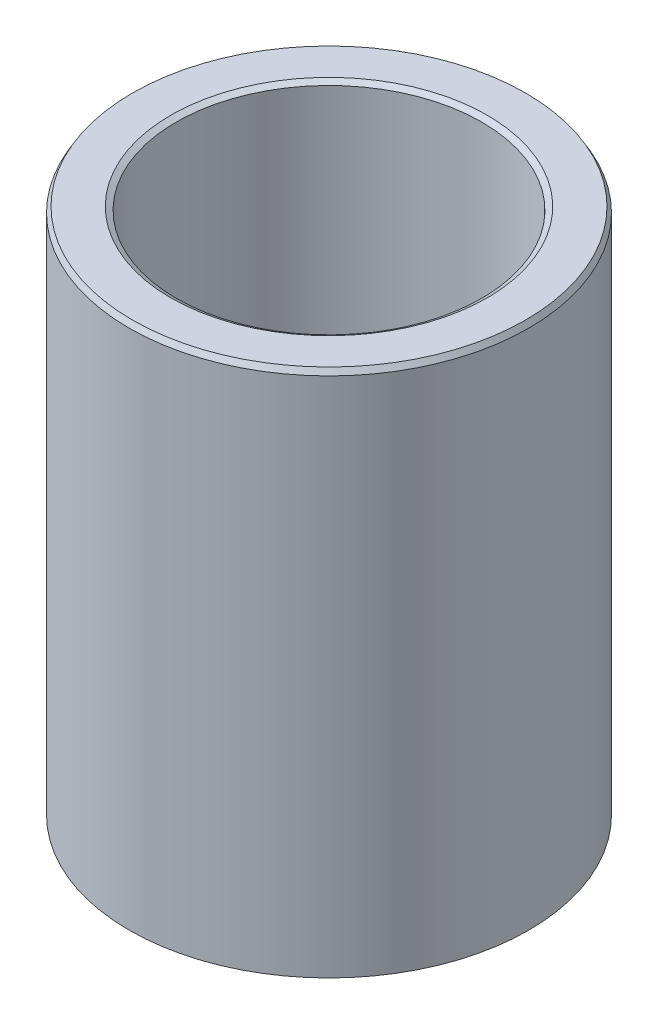
ISO-10303-21;
HEADER;
FILE_DESCRIPTION(('STEP AP214'),'2;1');
FILE_NAME('part.step','',(''),(''),'','','');
FILE_SCHEMA(('AUTOMOTIVE_DESIGN { 1 0 10303 214 1 1 1 1 }'));
ENDSEC;
DATA;
#1=APPLICATION_CONTEXT('core data for automotive mechanical design processes');
#2=APPLICATION_PROTOCOL_DEFINITION('international standard','automotive_design',2000,#1);
#3=PRODUCT_CONTEXT('',#1,'mechanical');
#4=PRODUCT('Part','Part','',(#3));
#5=PRODUCT_RELATED_PRODUCT_CATEGORY('part','',(#4));
#6=PRODUCT_DEFINITION_FORMATION('','',#4);
#7=PRODUCT_DEFINITION_CONTEXT('part definition',#1,'design');
#8=PRODUCT_DEFINITION('design','',#6,#7);
#9=PRODUCT_DEFINITION_SHAPE('','',#8);
#10=(LENGTH_UNIT() NAMED_UNIT(*) SI_UNIT(.MILLI.,.METRE.));
#11=(NAMED_UNIT(*) PLANE_ANGLE_UNIT() SI_UNIT($,.RADIAN.));
#12=(NAMED_UNIT(*) SI_UNIT($,.STERADIAN.) SOLID_ANGLE_UNIT());
#13=UNCERTAINTY_MEASURE_WITH_UNIT(LENGTH_MEASURE(1.E-05),#10,'distance_accuracy_value','');
#14=(GEOMETRIC_REPRESENTATION_CONTEXT(3) GLOBAL_UNCERTAINTY_ASSIGNED_CONTEXT((#13)) GLOBAL_UNIT_ASSIGNED_CONTEXT((#10,
#11,#12)) REPRESENTATION_CONTEXT('',''));
#15=CARTESIAN_POINT('',(0.,0.,0.));
#16=DIRECTION('',(0.,0.,1.));
#17=DIRECTION('',(1.,0.,0.));
#18=AXIS2_PLACEMENT_3D('',#15,#16,#17);
#19=CARTESIAN_POINT('',(0.,46.4336161929671,0.));
#20=DIRECTION('',(0.,-1.,0.));
#21=DIRECTION('',(0.,0.,-1.));
#22=AXIS2_PLACEMENT_3D('',#19,#20,#21);
#23=CYLINDRICAL_SURFACE('',#22,17.5);
#24=CARTESIAN_POINT('',(0.,0.277660741693039,0.));
#25=DIRECTION('',(0.,1.,0.));
#26=DIRECTION('',(0.,0.,1.));
#27=AXIS2_PLACEMENT_3D('',#24,#25,#26);
#28=CIRCLE('',#27,17.5);
#29=CARTESIAN_POINT('',(0.,0.277660741693039,17.5));
#30=VERTEX_POINT('',#29);
#31=EDGE_CURVE('E10',#30,#30,#28,.T.);
#32=ORIENTED_EDGE('',*,*,#31,.T.);
#33=EDGE_LOOP('',(#32));
#34=FACE_BOUND('',#33,.T.);
#35=CARTESIAN_POINT('',(0.,45.9526936810874,0.));
#36=DIRECTION('',(0.,1.,0.));
#37=DIRECTION('',(0.,0.,1.));
#38=AXIS2_PLACEMENT_3D('',#35,#36,#37);
#39=CIRCLE('',#38,17.5);
#40=CARTESIAN_POINT('',(0.,45.9526936810874,-17.5));
#41=VERTEX_POINT('',#40);
#42=EDGE_CURVE('E50',#41,#41,#39,.F.);
#43=ORIENTED_EDGE('',*,*,#42,.T.);
#44=EDGE_LOOP('',(#43));
#45=FACE_BOUND('',#44,.T.);
#46=ADVANCED_FACE('F39',(#34,#45),#23,.T.);
#47=CARTESIAN_POINT('',(0.,46.4336161929671,0.));
#48=DIRECTION('',(0.,1.,0.));
#49=DIRECTION('',(0.,0.,1.));
#50=AXIS2_PLACEMENT_3D('',#47,#48,#49);
#51=PLANE('',#50);
#52=CARTESIAN_POINT('',(0.,46.4336161929671,0.));
#53=DIRECTION('',(0.,1.,0.));
#54=DIRECTION('',(0.,0.,1.));
#55=AXIS2_PLACEMENT_3D('',#52,#53,#54);
#56=CIRCLE('',#55,13.8599849736246);
#57=CARTESIAN_POINT('',(0.,46.4336161929671,13.8599849736246));
#58=VERTEX_POINT('',#57);
#59=EDGE_CURVE('E58',#58,#58,#56,.F.);
#60=ORIENTED_EDGE('',*,*,#59,.T.);
#61=EDGE_LOOP('',(#60));
#62=FACE_BOUND('',#61,.T.);
#63=CARTESIAN_POINT('',(0.,46.4336161929671,0.));
#64=DIRECTION('',(0.,1.,0.));
#65=DIRECTION('',(0.,0.,1.));
#66=AXIS2_PLACEMENT_3D('',#63,#64,#65);
#67=CIRCLE('',#66,17.222339258307);
#68=CARTESIAN_POINT('',(0.,46.4336161929671,-17.222339258307));
#69=VERTEX_POINT('',#68);
#70=EDGE_CURVE('E61',#69,#69,#67,.T.);
#71=ORIENTED_EDGE('',*,*,#70,.T.);
#72=EDGE_LOOP('',(#71));
#73=FACE_BOUND('',#72,.T.);
#74=ADVANCED_FACE('F88',(#62,#73),#51,.T.);
#75=CARTESIAN_POINT('',(0.,0.,0.));
#76=DIRECTION('',(0.,1.,0.));
#77=DIRECTION('',(0.,0.,1.));
#78=AXIS2_PLACEMENT_3D('',#75,#76,#77);
#79=PLANE('',#78);
#80=CARTESIAN_POINT('',(0.,0.,0.));
#81=DIRECTION('',(0.,1.,0.));
#82=DIRECTION('',(0.,0.,1.));
#83=AXIS2_PLACEMENT_3D('',#80,#81,#82);
#84=CIRCLE('',#83,13.656723203438);
#85=CARTESIAN_POINT('',(0.,0.,13.656723203438));
#86=VERTEX_POINT('',#85);
#87=EDGE_CURVE('E51',#86,#86,#84,.T.);
#88=ORIENTED_EDGE('',*,*,#87,.T.);
#89=EDGE_LOOP('',(#88));
#90=FACE_BOUND('',#89,.T.);
#91=CARTESIAN_POINT('',(0.,0.,0.));
#92=DIRECTION('',(0.,1.,0.));
#93=DIRECTION('',(0.,0.,1.));
#94=AXIS2_PLACEMENT_3D('',#91,#92,#93);
#95=CIRCLE('',#94,17.0190774881204);
#96=CARTESIAN_POINT('',(0.,0.,17.0190774881204));
#97=VERTEX_POINT('',#96);
#98=EDGE_CURVE('E54',#97,#97,#95,.F.);
#99=ORIENTED_EDGE('',*,*,#98,.T.);
#100=EDGE_LOOP('',(#99));
#101=FACE_BOUND('',#100,.T.);
#102=ADVANCED_FACE('F83',(#90,#101),#79,.F.);
#103=CARTESIAN_POINT('',(0.,46.4336161929671,0.));
#104=DIRECTION('',(0.,-1.,0.));
#105=DIRECTION('',(0.,0.,-1.));
#106=AXIS2_PLACEMENT_3D('',#103,#104,#105);
#107=CYLINDRICAL_SURFACE('',#106,13.379062461745);
#108=CARTESIAN_POINT('',(0.,46.155955451274,0.));
#109=DIRECTION('',(0.,1.,0.));
#110=DIRECTION('',(0.,0.,1.));
#111=AXIS2_PLACEMENT_3D('',#108,#109,#110);
#112=CIRCLE('',#111,13.379062461745);
#113=CARTESIAN_POINT('',(0.,46.155955451274,13.379062461745));
#114=VERTEX_POINT('',#113);
#115=EDGE_CURVE('E67',#114,#114,#112,.T.);
#116=ORIENTED_EDGE('',*,*,#115,.T.);
#117=EDGE_LOOP('',(#116));
#118=FACE_BOUND('',#117,.T.);
#119=CARTESIAN_POINT('',(0.,0.480922511879589,0.));
#120=DIRECTION('',(0.,1.,0.));
#121=DIRECTION('',(0.,0.,1.));
#122=AXIS2_PLACEMENT_3D('',#119,#120,#121);
#123=CIRCLE('',#122,13.379062461745);
#124=CARTESIAN_POINT('',(0.,0.480922511879589,13.379062461745));
#125=VERTEX_POINT('',#124);
#126=EDGE_CURVE('E69',#125,#125,#123,.F.);
#127=ORIENTED_EDGE('',*,*,#126,.T.);
#128=EDGE_LOOP('',(#127));
#129=FACE_BOUND('',#128,.T.);
#130=ADVANCED_FACE('F71',(#118,#129),#107,.F.);
#131=CARTESIAN_POINT('',(0.,46.155955451274,0.));
#132=DIRECTION('',(0.,1.,0.));
#133=DIRECTION('',(0.,0.,1.));
#134=AXIS2_PLACEMENT_3D('',#131,#132,#133);
#135=CONICAL_SURFACE('',#134,13.379062461745,1.04719755119659);
#136=ORIENTED_EDGE('',*,*,#59,.F.);
#137=EDGE_LOOP('',(#136));
#138=FACE_BOUND('',#137,.T.);
#139=ORIENTED_EDGE('',*,*,#115,.F.);
#140=EDGE_LOOP('',(#139));
#141=FACE_BOUND('',#140,.T.);
#142=ADVANCED_FACE('F77',(#138,#141),#135,.F.);
#143=CARTESIAN_POINT('',(0.,0.,0.));
#144=DIRECTION('',(0.,-1.,0.));
#145=DIRECTION('',(0.,0.,-1.));
#146=AXIS2_PLACEMENT_3D('',#143,#144,#145);
#147=CONICAL_SURFACE('',#146,13.656723203438,0.523598775598294);
#148=ORIENTED_EDGE('',*,*,#126,.F.);
#149=EDGE_LOOP('',(#148));
#150=FACE_BOUND('',#149,.T.);
#151=ORIENTED_EDGE('',*,*,#87,.F.);
#152=EDGE_LOOP('',(#151));
#153=FACE_BOUND('',#152,.T.);
#154=ADVANCED_FACE('F73',(#150,#153),#147,.F.);
#155=CARTESIAN_POINT('',(0.,0.277660741693039,0.));
#156=DIRECTION('',(0.,1.,0.));
#157=DIRECTION('',(0.,0.,1.));
#158=AXIS2_PLACEMENT_3D('',#155,#156,#157);
#159=CONICAL_SURFACE('',#158,17.5,1.0471975511966);
#160=ORIENTED_EDGE('',*,*,#98,.F.);
#161=EDGE_LOOP('',(#160));
#162=FACE_BOUND('',#161,.T.);
#163=ORIENTED_EDGE('',*,*,#31,.F.);
#164=EDGE_LOOP('',(#163));
#165=FACE_BOUND('',#164,.T.);
#166=ADVANCED_FACE('F76',(#162,#165),#159,.T.);
#167=CARTESIAN_POINT('',(0.,46.4336161929671,0.));
#168=DIRECTION('',(0.,-1.,0.));
#169=DIRECTION('',(0.,0.,-1.));
#170=AXIS2_PLACEMENT_3D('',#167,#168,#169);
#171=CONICAL_SURFACE('',#170,17.222339258307,0.523598775598285);
#172=CARTESIAN_POINT('',(0.,45.9526936810874,-17.5));
#173=CARTESIAN_POINT('',(0.,45.9577032905862,-17.4971077006074));
#174=CARTESIAN_POINT('',(0.,45.9627129000849,-17.4942154012147));
#175=CARTESIAN_POINT('',(0.,45.9727321190824,-17.4884308024295));
#176=CARTESIAN_POINT('',(0.,45.9777417285812,-17.4855385030368));
#177=CARTESIAN_POINT('',(0.,45.9877609475787,-17.4797539042516));
#178=CARTESIAN_POINT('',(0.,45.9927705570774,-17.4768616048589));
#179=CARTESIAN_POINT('',(0.,46.0027897760749,-17.4710770060736));
#180=CARTESIAN_POINT('',(0.,46.0077993855736,-17.468184706681));
#181=CARTESIAN_POINT('',(0.,46.0178186045711,-17.4624001078957));
#182=CARTESIAN_POINT('',(0.,46.0228282140699,-17.4595078085031));
#183=CARTESIAN_POINT('',(0.,46.0328474330674,-17.4537232097178));
#184=CARTESIAN_POINT('',(0.,46.0378570425661,-17.4508309103252));
#185=CARTESIAN_POINT('',(0.,46.0478762615636,-17.4450463115399));
#186=CARTESIAN_POINT('',(0.,46.0528858710624,-17.4421540121473));
#187=CARTESIAN_POINT('',(0.,46.0629050900599,-17.436369413362));
#188=CARTESIAN_POINT('',(0.,46.0679146995586,-17.4334771139694));
#189=CARTESIAN_POINT('',(0.,46.0779339185561,-17.4276925151841));
#190=CARTESIAN_POINT('',(0.,46.0829435280548,-17.4248002157915));
#191=CARTESIAN_POINT('',(0.,46.0929627470523,-17.4190156170062));
#192=CARTESIAN_POINT('',(0.,46.0979723565511,-17.4161233176136));
#193=CARTESIAN_POINT('',(0.,46.1079915755486,-17.4103387188283));
#194=CARTESIAN_POINT('',(0.,46.1130011850473,-17.4074464194357));
#195=CARTESIAN_POINT('',(0.,46.1230204040448,-17.4016618206504));
#196=CARTESIAN_POINT('',(0.,46.1280300135436,-17.3987695212578));
#197=CARTESIAN_POINT('',(0.,46.138049232541,-17.3929849224725));
#198=CARTESIAN_POINT('',(0.,46.1430588420398,-17.3900926230798));
#199=CARTESIAN_POINT('',(0.,46.1530780610373,-17.3843080242946));
#200=CARTESIAN_POINT('',(0.,46.158087670536,-17.3814157249019));
#201=CARTESIAN_POINT('',(0.,46.1681068895335,-17.3756311261167));
#202=CARTESIAN_POINT('',(0.,46.1731164990323,-17.372738826724));
#203=CARTESIAN_POINT('',(0.,46.1831357180298,-17.3669542279388));
#204=CARTESIAN_POINT('',(0.,46.1881453275285,-17.3640619285461));
#205=CARTESIAN_POINT('',(0.,46.198164546526,-17.3582773297608));
#206=CARTESIAN_POINT('',(0.,46.2031741560247,-17.3553850303682));
#207=CARTESIAN_POINT('',(0.,46.2131933750222,-17.3496004315829));
#208=CARTESIAN_POINT('',(0.,46.218202984521,-17.3467081321903));
#209=CARTESIAN_POINT('',(0.,46.2282222035185,-17.340923533405));
#210=CARTESIAN_POINT('',(0.,46.2332318130172,-17.3380312340124));
#211=CARTESIAN_POINT('',(0.,46.2432510320147,-17.3322466352271));
#212=CARTESIAN_POINT('',(0.,46.2482606415135,-17.3293543358345));
#213=CARTESIAN_POINT('',(0.,46.2582798605109,-17.3235697370492));
#214=CARTESIAN_POINT('',(0.,46.2632894700097,-17.3206774376566));
#215=CARTESIAN_POINT('',(0.,46.2733086890072,-17.3148928388713));
#216=CARTESIAN_POINT('',(0.,46.2783182985059,-17.3120005394787));
#217=CARTESIAN_POINT('',(0.,46.2883375175034,-17.3062159406934));
#218=CARTESIAN_POINT('',(0.,46.2933471270022,-17.3033236413008));
#219=CARTESIAN_POINT('',(0.,46.3033663459997,-17.2975390425155));
#220=CARTESIAN_POINT('',(0.,46.3083759554984,-17.2946467431229));
#221=CARTESIAN_POINT('',(0.,46.3183951744959,-17.2888621443376));
#222=CARTESIAN_POINT('',(0.,46.3234047839946,-17.285969844945));
#223=CARTESIAN_POINT('',(0.,46.3334240029921,-17.2801852461597));
#224=CARTESIAN_POINT('',(0.,46.3384336124909,-17.277292946767));
#225=CARTESIAN_POINT('',(0.,46.3484528314884,-17.2715083479818));
#226=CARTESIAN_POINT('',(0.,46.3534624409871,-17.2686160485891));
#227=CARTESIAN_POINT('',(0.,46.3634816599846,-17.2628314498039));
#228=CARTESIAN_POINT('',(0.,46.3684912694834,-17.2599391504112));
#229=CARTESIAN_POINT('',(0.,46.3785104884808,-17.254154551626));
#230=CARTESIAN_POINT('',(0.,46.3835200979796,-17.2512622522333));
#231=CARTESIAN_POINT('',(0.,46.3935393169771,-17.2454776534481));
#232=CARTESIAN_POINT('',(0.,46.3985489264758,-17.2425853540554));
#233=CARTESIAN_POINT('',(0.,46.4085681454733,-17.2368007552701));
#234=CARTESIAN_POINT('',(0.,46.4135777549721,-17.2339084558775));
#235=CARTESIAN_POINT('',(0.,46.4235969739696,-17.2281238570922));
#236=CARTESIAN_POINT('',(0.,46.4286065834683,-17.2252315576996));
#237=CARTESIAN_POINT('',(0.,46.4336161929671,-17.222339258307));
#238=B_SPLINE_CURVE_WITH_KNOTS('',3,(#172,#173,#174,#175,#176,#177,#178,#179,#180,#181,#182,
#183,#184,#185,#186,#187,#188,#189,#190,#191,#192,#193,#194,#195,#196,#197,#198,#199,#200,#201,
#202,#203,#204,#205,#206,#207,#208,#209,#210,#211,#212,#213,#214,#215,#216,#217,#218,#219,#220,
#221,#222,#223,#224,#225,#226,#227,#228,#229,#230,#231,#232,#233,#234,#235,#236,#237),
.UNSPECIFIED.,.F.,.F.,(4,2,2,2,2,2,2,2,2,2,2,2,2,2,2,2,2,2,2,2,2,2,2,2,2,2,2,2,2,2,2,2,4),(0.,
0.0173537963558217,0.0347075927116356,0.0520613890674513,0.0694151854232653,0.0867689817790792,
0.104122778134895,0.121476574490715,0.138830370846531,0.156184167202345,0.173537963558158,
0.190891759913974,0.208245556269788,0.22559935262561,0.242953148981424,0.260306945337239,
0.277660741693053,0.295014538048867,0.312368334404683,0.329722130760497,0.347075927116319,
0.364429723472132,0.381783519827946,0.399137316183762,0.416491112539576,0.433844908895392,
0.451198705251212,0.468552501607026,0.485906297962841,0.503260094318655,0.520613890674471,
0.537967687030285,0.555321483386105),.UNSPECIFIED.);
#239=EDGE_CURVE('BSEAM45',#41,#69,#238,.T.);
#240=ORIENTED_EDGE('',*,*,#42,.F.);
#241=ORIENTED_EDGE('',*,*,#70,.F.);
#242=ORIENTED_EDGE('',*,*,#239,.T.);
#243=ORIENTED_EDGE('',*,*,#239,.F.);
#244=EDGE_LOOP('',(#240,#242,#241,#243));
#245=FACE_BOUND('',#244,.T.);
#246=ADVANCED_FACE('F45',(#245),#171,.T.);
#247=CLOSED_SHELL('',(#46,#74,#102,#130,#142,#154,#166,#246));
#248=MANIFOLD_SOLID_BREP('B2',#247);
#249=ADVANCED_BREP_SHAPE_REPRESENTATION('',(#18,#248),#14);
#250=SHAPE_DEFINITION_REPRESENTATION(#9,#249);
ENDSEC;
END-ISO-10303-21;
